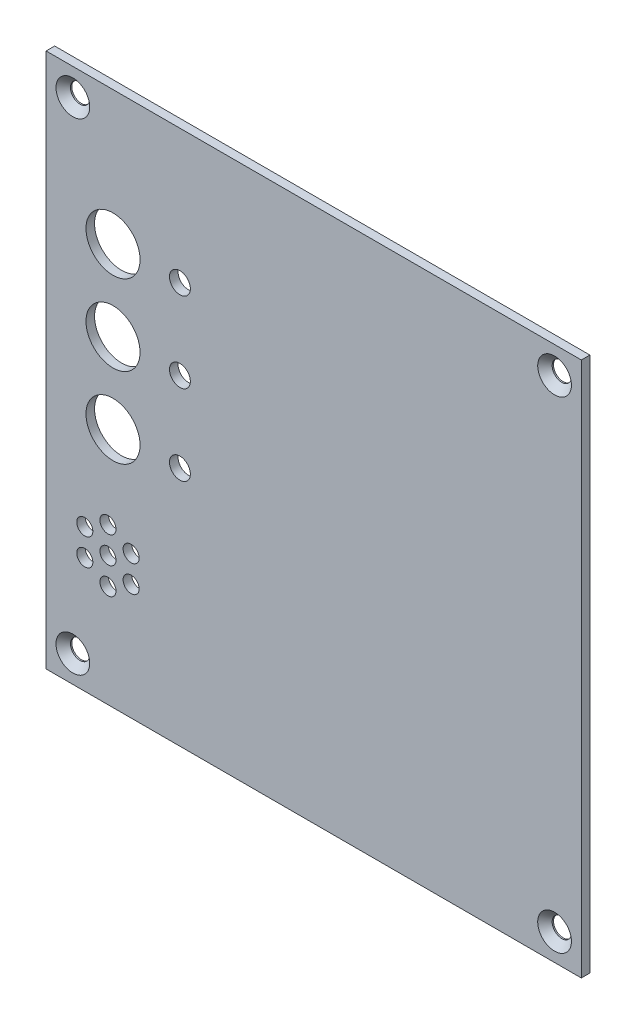
ISO-10303-21;
HEADER;
FILE_DESCRIPTION(('STEP AP214'),'2;1');
FILE_NAME('part.step','',(''),(''),'','','');
FILE_SCHEMA(('AUTOMOTIVE_DESIGN { 1 0 10303 214 1 1 1 1 }'));
ENDSEC;
DATA;
#1=APPLICATION_CONTEXT('core data for automotive mechanical design processes');
#2=APPLICATION_PROTOCOL_DEFINITION('international standard','automotive_design',2000,#1);
#3=PRODUCT_CONTEXT('',#1,'mechanical');
#4=PRODUCT('Part','Part','',(#3));
#5=PRODUCT_RELATED_PRODUCT_CATEGORY('part','',(#4));
#6=PRODUCT_DEFINITION_FORMATION('','',#4);
#7=PRODUCT_DEFINITION_CONTEXT('part definition',#1,'design');
#8=PRODUCT_DEFINITION('design','',#6,#7);
#9=PRODUCT_DEFINITION_SHAPE('','',#8);
#10=(LENGTH_UNIT() NAMED_UNIT(*) SI_UNIT(.MILLI.,.METRE.));
#11=(NAMED_UNIT(*) PLANE_ANGLE_UNIT() SI_UNIT($,.RADIAN.));
#12=(NAMED_UNIT(*) SI_UNIT($,.STERADIAN.) SOLID_ANGLE_UNIT());
#13=UNCERTAINTY_MEASURE_WITH_UNIT(LENGTH_MEASURE(1.E-05),#10,'distance_accuracy_value','');
#14=(GEOMETRIC_REPRESENTATION_CONTEXT(3) GLOBAL_UNCERTAINTY_ASSIGNED_CONTEXT((#13)) GLOBAL_UNIT_ASSIGNED_CONTEXT((#10,
#11,#12)) REPRESENTATION_CONTEXT('',''));
#15=CARTESIAN_POINT('',(0.,0.,0.));
#16=DIRECTION('',(0.,0.,1.));
#17=DIRECTION('',(1.,0.,0.));
#18=AXIS2_PLACEMENT_3D('',#15,#16,#17);
#19=CARTESIAN_POINT('',(0.,0.,0.));
#20=DIRECTION('',(0.,0.,-1.));
#21=DIRECTION('',(-1.,0.,0.));
#22=AXIS2_PLACEMENT_3D('',#19,#20,#21);
#23=PLANE('',#22);
#24=CARTESIAN_POINT('',(7.22687298107787,21.63,0.));
#25=DIRECTION('',(0.,0.,1.));
#26=DIRECTION('',(1.,0.,0.));
#27=AXIS2_PLACEMENT_3D('',#24,#25,#26);
#28=CIRCLE('',#27,1.5);
#29=CARTESIAN_POINT('',(8.72687298107787,21.63,0.));
#30=VERTEX_POINT('',#29);
#31=EDGE_CURVE('E182',#30,#30,#28,.T.);
#32=ORIENTED_EDGE('',*,*,#31,.T.);
#33=EDGE_LOOP('',(#32));
#34=FACE_BOUND('',#33,.T.);
#35=CARTESIAN_POINT('',(11.5570000000001,19.13,0.));
#36=DIRECTION('',(0.,0.,1.));
#37=DIRECTION('',(1.,0.,0.));
#38=AXIS2_PLACEMENT_3D('',#35,#36,#37);
#39=CIRCLE('',#38,1.5);
#40=CARTESIAN_POINT('',(13.0570000000001,19.13,0.));
#41=VERTEX_POINT('',#40);
#42=EDGE_CURVE('E189',#41,#41,#39,.T.);
#43=ORIENTED_EDGE('',*,*,#42,.T.);
#44=EDGE_LOOP('',(#43));
#45=FACE_BOUND('',#44,.T.);
#46=CARTESIAN_POINT('',(15.8871270189223,21.63,0.));
#47=DIRECTION('',(0.,0.,1.));
#48=DIRECTION('',(1.,0.,0.));
#49=AXIS2_PLACEMENT_3D('',#46,#47,#48);
#50=CIRCLE('',#49,1.5);
#51=CARTESIAN_POINT('',(17.3871270189223,21.63,0.));
#52=VERTEX_POINT('',#51);
#53=EDGE_CURVE('E195',#52,#52,#50,.T.);
#54=ORIENTED_EDGE('',*,*,#53,.T.);
#55=EDGE_LOOP('',(#54));
#56=FACE_BOUND('',#55,.T.);
#57=CARTESIAN_POINT('',(15.8871270189222,26.63,0.));
#58=DIRECTION('',(0.,0.,1.));
#59=DIRECTION('',(1.,0.,0.));
#60=AXIS2_PLACEMENT_3D('',#57,#58,#59);
#61=CIRCLE('',#60,1.5);
#62=CARTESIAN_POINT('',(17.3871270189222,26.63,0.));
#63=VERTEX_POINT('',#62);
#64=EDGE_CURVE('E171',#63,#63,#61,.T.);
#65=ORIENTED_EDGE('',*,*,#64,.T.);
#66=EDGE_LOOP('',(#65));
#67=FACE_BOUND('',#66,.T.);
#68=CARTESIAN_POINT('',(25.,75.,0.));
#69=DIRECTION('',(0.,0.,1.));
#70=DIRECTION('',(1.,0.,0.));
#71=AXIS2_PLACEMENT_3D('',#68,#69,#70);
#72=CIRCLE('',#71,1.94999999999999);
#73=CARTESIAN_POINT('',(26.95,75.,0.));
#74=VERTEX_POINT('',#73);
#75=EDGE_CURVE('E152',#74,#74,#72,.T.);
#76=ORIENTED_EDGE('',*,*,#75,.T.);
#77=EDGE_LOOP('',(#76));
#78=FACE_BOUND('',#77,.T.);
#79=CARTESIAN_POINT('',(11.557,24.13,0.));
#80=DIRECTION('',(0.,0.,1.));
#81=DIRECTION('',(1.,0.,0.));
#82=AXIS2_PLACEMENT_3D('',#79,#80,#81);
#83=CIRCLE('',#82,1.5);
#84=CARTESIAN_POINT('',(13.057,24.13,0.));
#85=VERTEX_POINT('',#84);
#86=EDGE_CURVE('E158',#85,#85,#83,.T.);
#87=ORIENTED_EDGE('',*,*,#86,.T.);
#88=EDGE_LOOP('',(#87));
#89=FACE_BOUND('',#88,.T.);
#90=CARTESIAN_POINT('',(12.5000000000002,60.,0.));
#91=DIRECTION('',(0.,0.,1.));
#92=DIRECTION('',(1.,0.,0.));
#93=AXIS2_PLACEMENT_3D('',#90,#91,#92);
#94=CIRCLE('',#93,5.05);
#95=CARTESIAN_POINT('',(17.5500000000002,60.,0.));
#96=VERTEX_POINT('',#95);
#97=EDGE_CURVE('E159',#96,#96,#94,.T.);
#98=ORIENTED_EDGE('',*,*,#97,.T.);
#99=EDGE_LOOP('',(#98));
#100=FACE_BOUND('',#99,.T.);
#101=CARTESIAN_POINT('',(11.557,29.13,0.));
#102=DIRECTION('',(0.,0.,1.));
#103=DIRECTION('',(1.,0.,0.));
#104=AXIS2_PLACEMENT_3D('',#101,#102,#103);
#105=CIRCLE('',#104,1.5);
#106=CARTESIAN_POINT('',(13.057,29.13,0.));
#107=VERTEX_POINT('',#106);
#108=EDGE_CURVE('E170',#107,#107,#105,.T.);
#109=ORIENTED_EDGE('',*,*,#108,.T.);
#110=EDGE_LOOP('',(#109));
#111=FACE_BOUND('',#110,.T.);
#112=CARTESIAN_POINT('',(7.22687298107785,26.63,0.));
#113=DIRECTION('',(0.,0.,1.));
#114=DIRECTION('',(1.,0.,0.));
#115=AXIS2_PLACEMENT_3D('',#112,#113,#114);
#116=CIRCLE('',#115,1.5);
#117=CARTESIAN_POINT('',(8.72687298107786,26.63,0.));
#118=VERTEX_POINT('',#117);
#119=EDGE_CURVE('E183',#118,#118,#116,.T.);
#120=ORIENTED_EDGE('',*,*,#119,.T.);
#121=EDGE_LOOP('',(#120));
#122=FACE_BOUND('',#121,.T.);
#123=CARTESIAN_POINT('',(12.5000000000003,45.,0.));
#124=DIRECTION('',(0.,0.,1.));
#125=DIRECTION('',(1.,0.,0.));
#126=AXIS2_PLACEMENT_3D('',#123,#124,#125);
#127=CIRCLE('',#126,5.05);
#128=CARTESIAN_POINT('',(17.5500000000003,45.,0.));
#129=VERTEX_POINT('',#128);
#130=EDGE_CURVE('E218',#129,#129,#127,.T.);
#131=ORIENTED_EDGE('',*,*,#130,.T.);
#132=EDGE_LOOP('',(#131));
#133=FACE_BOUND('',#132,.T.);
#134=CARTESIAN_POINT('',(25.,60.,0.));
#135=DIRECTION('',(0.,0.,1.));
#136=DIRECTION('',(1.,0.,0.));
#137=AXIS2_PLACEMENT_3D('',#134,#135,#136);
#138=CIRCLE('',#137,1.95);
#139=CARTESIAN_POINT('',(26.95,60.,0.));
#140=VERTEX_POINT('',#139);
#141=EDGE_CURVE('E212',#140,#140,#138,.T.);
#142=ORIENTED_EDGE('',*,*,#141,.T.);
#143=EDGE_LOOP('',(#142));
#144=FACE_BOUND('',#143,.T.);
#145=CARTESIAN_POINT('',(25.,45.,0.));
#146=DIRECTION('',(0.,0.,1.));
#147=DIRECTION('',(1.,0.,0.));
#148=AXIS2_PLACEMENT_3D('',#145,#146,#147);
#149=CIRCLE('',#148,1.95);
#150=CARTESIAN_POINT('',(26.95,45.,0.));
#151=VERTEX_POINT('',#150);
#152=EDGE_CURVE('E206',#151,#151,#149,.T.);
#153=ORIENTED_EDGE('',*,*,#152,.T.);
#154=EDGE_LOOP('',(#153));
#155=FACE_BOUND('',#154,.T.);
#156=CARTESIAN_POINT('',(12.5,75.,0.));
#157=DIRECTION('',(0.,0.,1.));
#158=DIRECTION('',(1.,0.,0.));
#159=AXIS2_PLACEMENT_3D('',#156,#157,#158);
#160=CIRCLE('',#159,5.05);
#161=CARTESIAN_POINT('',(17.55,75.,0.));
#162=VERTEX_POINT('',#161);
#163=EDGE_CURVE('E148',#162,#162,#160,.T.);
#164=ORIENTED_EDGE('',*,*,#163,.T.);
#165=EDGE_LOOP('',(#164));
#166=FACE_BOUND('',#165,.T.);
#167=CARTESIAN_POINT('',(4.99999999999999,95.,0.));
#168=DIRECTION('',(0.,0.,1.));
#169=DIRECTION('',(1.,0.,0.));
#170=AXIS2_PLACEMENT_3D('',#167,#168,#169);
#171=CIRCLE('',#170,1.8);
#172=CARTESIAN_POINT('',(6.79999999999999,95.,0.));
#173=VERTEX_POINT('',#172);
#174=EDGE_CURVE('E139',#173,#173,#171,.T.);
#175=ORIENTED_EDGE('',*,*,#174,.T.);
#176=EDGE_LOOP('',(#175));
#177=FACE_BOUND('',#176,.T.);
#178=CARTESIAN_POINT('',(95.,95.,0.));
#179=DIRECTION('',(0.,0.,1.));
#180=DIRECTION('',(1.,0.,0.));
#181=AXIS2_PLACEMENT_3D('',#178,#179,#180);
#182=CIRCLE('',#181,1.8);
#183=CARTESIAN_POINT('',(96.8,95.,0.));
#184=VERTEX_POINT('',#183);
#185=EDGE_CURVE('E130',#184,#184,#182,.T.);
#186=ORIENTED_EDGE('',*,*,#185,.T.);
#187=EDGE_LOOP('',(#186));
#188=FACE_BOUND('',#187,.T.);
#189=DIRECTION('',(0.,-1.,0.));
#190=VECTOR('',#189,1.);
#191=CARTESIAN_POINT('',(0.,0.,0.));
#192=LINE('',#191,#190);
#193=CARTESIAN_POINT('',(0.,100.,0.));
#194=VERTEX_POINT('',#193);
#195=CARTESIAN_POINT('',(0.,0.,0.));
#196=VERTEX_POINT('',#195);
#197=EDGE_CURVE('E99',#194,#196,#192,.T.);
#198=ORIENTED_EDGE('',*,*,#197,.F.);
#199=DIRECTION('',(-1.,0.,0.));
#200=VECTOR('',#199,1.);
#201=CARTESIAN_POINT('',(0.,100.,0.));
#202=LINE('',#201,#200);
#203=CARTESIAN_POINT('',(100.,100.,0.));
#204=VERTEX_POINT('',#203);
#205=EDGE_CURVE('E75',#204,#194,#202,.T.);
#206=ORIENTED_EDGE('',*,*,#205,.F.);
#207=DIRECTION('',(0.,1.,0.));
#208=VECTOR('',#207,1.);
#209=CARTESIAN_POINT('',(100.,0.,0.));
#210=LINE('',#209,#208);
#211=CARTESIAN_POINT('',(100.,0.,0.));
#212=VERTEX_POINT('',#211);
#213=EDGE_CURVE('E69',#212,#204,#210,.T.);
#214=ORIENTED_EDGE('',*,*,#213,.F.);
#215=DIRECTION('',(1.,0.,0.));
#216=VECTOR('',#215,1.);
#217=CARTESIAN_POINT('',(0.,0.,0.));
#218=LINE('',#217,#216);
#219=EDGE_CURVE('E91',#196,#212,#218,.T.);
#220=ORIENTED_EDGE('',*,*,#219,.F.);
#221=EDGE_LOOP('',(#198,#206,#214,#220));
#222=FACE_BOUND('',#221,.T.);
#223=CARTESIAN_POINT('',(4.99999999999999,5.,0.));
#224=DIRECTION('',(0.,0.,1.));
#225=DIRECTION('',(1.,0.,0.));
#226=AXIS2_PLACEMENT_3D('',#223,#224,#225);
#227=CIRCLE('',#226,1.8);
#228=CARTESIAN_POINT('',(6.79999999999999,5.,0.));
#229=VERTEX_POINT('',#228);
#230=EDGE_CURVE('E102',#229,#229,#227,.T.);
#231=ORIENTED_EDGE('',*,*,#230,.T.);
#232=EDGE_LOOP('',(#231));
#233=FACE_BOUND('',#232,.T.);
#234=CARTESIAN_POINT('',(95.,5.,0.));
#235=DIRECTION('',(0.,0.,1.));
#236=DIRECTION('',(1.,0.,0.));
#237=AXIS2_PLACEMENT_3D('',#234,#235,#236);
#238=CIRCLE('',#237,1.8);
#239=CARTESIAN_POINT('',(96.8,5.,0.));
#240=VERTEX_POINT('',#239);
#241=EDGE_CURVE('E121',#240,#240,#238,.T.);
#242=ORIENTED_EDGE('',*,*,#241,.T.);
#243=EDGE_LOOP('',(#242));
#244=FACE_BOUND('',#243,.T.);
#245=ADVANCED_FACE('F35',(#34,#45,#56,#67,#78,#89,#100,#111,#122,#133,#144,#155,#166,#177,#188,
#222,#233,#244),#23,.T.);
#246=CARTESIAN_POINT('',(0.,0.,1.6));
#247=DIRECTION('',(1.,0.,0.));
#248=DIRECTION('',(0.,1.,0.));
#249=AXIS2_PLACEMENT_3D('',#246,#247,#248);
#250=PLANE('',#249);
#251=ORIENTED_EDGE('',*,*,#197,.T.);
#252=DIRECTION('',(0.,0.,-1.));
#253=VECTOR('',#252,1.);
#254=CARTESIAN_POINT('',(0.,0.,1.6));
#255=LINE('',#254,#253);
#256=CARTESIAN_POINT('',(0.,0.,1.6));
#257=VERTEX_POINT('',#256);
#258=EDGE_CURVE('E11',#257,#196,#255,.T.);
#259=ORIENTED_EDGE('',*,*,#258,.F.);
#260=DIRECTION('',(0.,-1.,0.));
#261=VECTOR('',#260,1.);
#262=CARTESIAN_POINT('',(0.,0.,1.6));
#263=LINE('',#262,#261);
#264=CARTESIAN_POINT('',(0.,100.,1.6));
#265=VERTEX_POINT('',#264);
#266=EDGE_CURVE('E87',#265,#257,#263,.T.);
#267=ORIENTED_EDGE('',*,*,#266,.F.);
#268=DIRECTION('',(0.,0.,-1.));
#269=VECTOR('',#268,1.);
#270=CARTESIAN_POINT('',(0.,100.,1.6));
#271=LINE('',#270,#269);
#272=EDGE_CURVE('E95',#265,#194,#271,.T.);
#273=ORIENTED_EDGE('',*,*,#272,.T.);
#274=EDGE_LOOP('',(#251,#259,#267,#273));
#275=FACE_BOUND('',#274,.T.);
#276=ADVANCED_FACE('F37',(#275),#250,.F.);
#277=CARTESIAN_POINT('',(0.,0.,1.6));
#278=DIRECTION('',(0.,1.,0.));
#279=DIRECTION('',(0.,0.,1.));
#280=AXIS2_PLACEMENT_3D('',#277,#278,#279);
#281=PLANE('',#280);
#282=ORIENTED_EDGE('',*,*,#219,.T.);
#283=DIRECTION('',(0.,0.,-1.));
#284=VECTOR('',#283,1.);
#285=CARTESIAN_POINT('',(100.,0.,1.6));
#286=LINE('',#285,#284);
#287=CARTESIAN_POINT('',(100.,0.,1.6));
#288=VERTEX_POINT('',#287);
#289=EDGE_CURVE('E44',#288,#212,#286,.T.);
#290=ORIENTED_EDGE('',*,*,#289,.F.);
#291=DIRECTION('',(1.,0.,0.));
#292=VECTOR('',#291,1.);
#293=CARTESIAN_POINT('',(0.,0.,1.6));
#294=LINE('',#293,#292);
#295=EDGE_CURVE('E82',#257,#288,#294,.T.);
#296=ORIENTED_EDGE('',*,*,#295,.F.);
#297=ORIENTED_EDGE('',*,*,#258,.T.);
#298=EDGE_LOOP('',(#282,#290,#296,#297));
#299=FACE_BOUND('',#298,.T.);
#300=ADVANCED_FACE('F90',(#299),#281,.F.);
#301=CARTESIAN_POINT('',(100.,0.,1.6));
#302=DIRECTION('',(-1.,0.,0.));
#303=DIRECTION('',(0.,-1.,0.));
#304=AXIS2_PLACEMENT_3D('',#301,#302,#303);
#305=PLANE('',#304);
#306=ORIENTED_EDGE('',*,*,#213,.T.);
#307=DIRECTION('',(0.,0.,-1.));
#308=VECTOR('',#307,1.);
#309=CARTESIAN_POINT('',(100.,100.,1.6));
#310=LINE('',#309,#308);
#311=CARTESIAN_POINT('',(100.,100.,1.6));
#312=VERTEX_POINT('',#311);
#313=EDGE_CURVE('E92',#312,#204,#310,.T.);
#314=ORIENTED_EDGE('',*,*,#313,.F.);
#315=DIRECTION('',(0.,1.,0.));
#316=VECTOR('',#315,1.);
#317=CARTESIAN_POINT('',(100.,0.,1.6));
#318=LINE('',#317,#316);
#319=EDGE_CURVE('E85',#288,#312,#318,.T.);
#320=ORIENTED_EDGE('',*,*,#319,.F.);
#321=ORIENTED_EDGE('',*,*,#289,.T.);
#322=EDGE_LOOP('',(#306,#314,#320,#321));
#323=FACE_BOUND('',#322,.T.);
#324=ADVANCED_FACE('F93',(#323),#305,.F.);
#325=CARTESIAN_POINT('',(0.,100.,1.6));
#326=DIRECTION('',(0.,-1.,0.));
#327=DIRECTION('',(0.,0.,-1.));
#328=AXIS2_PLACEMENT_3D('',#325,#326,#327);
#329=PLANE('',#328);
#330=ORIENTED_EDGE('',*,*,#205,.T.);
#331=ORIENTED_EDGE('',*,*,#272,.F.);
#332=DIRECTION('',(-1.,0.,0.));
#333=VECTOR('',#332,1.);
#334=CARTESIAN_POINT('',(0.,100.,1.6));
#335=LINE('',#334,#333);
#336=EDGE_CURVE('E52',#312,#265,#335,.T.);
#337=ORIENTED_EDGE('',*,*,#336,.F.);
#338=ORIENTED_EDGE('',*,*,#313,.T.);
#339=EDGE_LOOP('',(#330,#331,#337,#338));
#340=FACE_BOUND('',#339,.T.);
#341=ADVANCED_FACE('F107',(#340),#329,.F.);
#342=CARTESIAN_POINT('',(0.,0.,1.6));
#343=DIRECTION('',(0.,0.,-1.));
#344=DIRECTION('',(-1.,0.,0.));
#345=AXIS2_PLACEMENT_3D('',#342,#343,#344);
#346=PLANE('',#345);
#347=CARTESIAN_POINT('',(7.22687298107787,21.63,1.6));
#348=DIRECTION('',(0.,0.,1.));
#349=DIRECTION('',(1.,0.,0.));
#350=AXIS2_PLACEMENT_3D('',#347,#348,#349);
#351=CIRCLE('',#350,1.5);
#352=CARTESIAN_POINT('',(8.72687298107787,21.63,1.6));
#353=VERTEX_POINT('',#352);
#354=EDGE_CURVE('E179',#353,#353,#351,.T.);
#355=ORIENTED_EDGE('',*,*,#354,.F.);
#356=EDGE_LOOP('',(#355));
#357=FACE_BOUND('',#356,.T.);
#358=CARTESIAN_POINT('',(11.5570000000001,19.13,1.6));
#359=DIRECTION('',(0.,0.,1.));
#360=DIRECTION('',(1.,0.,0.));
#361=AXIS2_PLACEMENT_3D('',#358,#359,#360);
#362=CIRCLE('',#361,1.5);
#363=CARTESIAN_POINT('',(13.0570000000001,19.13,1.6));
#364=VERTEX_POINT('',#363);
#365=EDGE_CURVE('E186',#364,#364,#362,.T.);
#366=ORIENTED_EDGE('',*,*,#365,.F.);
#367=EDGE_LOOP('',(#366));
#368=FACE_BOUND('',#367,.T.);
#369=CARTESIAN_POINT('',(15.8871270189223,21.63,1.6));
#370=DIRECTION('',(0.,0.,1.));
#371=DIRECTION('',(1.,0.,0.));
#372=AXIS2_PLACEMENT_3D('',#369,#370,#371);
#373=CIRCLE('',#372,1.5);
#374=CARTESIAN_POINT('',(17.3871270189223,21.63,1.6));
#375=VERTEX_POINT('',#374);
#376=EDGE_CURVE('E192',#375,#375,#373,.T.);
#377=ORIENTED_EDGE('',*,*,#376,.F.);
#378=EDGE_LOOP('',(#377));
#379=FACE_BOUND('',#378,.T.);
#380=CARTESIAN_POINT('',(15.8871270189222,26.63,1.6));
#381=DIRECTION('',(0.,0.,1.));
#382=DIRECTION('',(1.,0.,0.));
#383=AXIS2_PLACEMENT_3D('',#380,#381,#382);
#384=CIRCLE('',#383,1.5);
#385=CARTESIAN_POINT('',(17.3871270189222,26.63,1.6));
#386=VERTEX_POINT('',#385);
#387=EDGE_CURVE('E198',#386,#386,#384,.T.);
#388=ORIENTED_EDGE('',*,*,#387,.F.);
#389=EDGE_LOOP('',(#388));
#390=FACE_BOUND('',#389,.T.);
#391=CARTESIAN_POINT('',(25.,75.,1.6));
#392=DIRECTION('',(0.,0.,1.));
#393=DIRECTION('',(1.,0.,0.));
#394=AXIS2_PLACEMENT_3D('',#391,#392,#393);
#395=CIRCLE('',#394,1.94999999999999);
#396=CARTESIAN_POINT('',(26.95,75.,1.6));
#397=VERTEX_POINT('',#396);
#398=EDGE_CURVE('E162',#397,#397,#395,.T.);
#399=ORIENTED_EDGE('',*,*,#398,.F.);
#400=EDGE_LOOP('',(#399));
#401=FACE_BOUND('',#400,.T.);
#402=CARTESIAN_POINT('',(11.557,24.13,1.6));
#403=DIRECTION('',(0.,0.,1.));
#404=DIRECTION('',(1.,0.,0.));
#405=AXIS2_PLACEMENT_3D('',#402,#403,#404);
#406=CIRCLE('',#405,1.5);
#407=CARTESIAN_POINT('',(13.057,24.13,1.6));
#408=VERTEX_POINT('',#407);
#409=EDGE_CURVE('E155',#408,#408,#406,.T.);
#410=ORIENTED_EDGE('',*,*,#409,.F.);
#411=EDGE_LOOP('',(#410));
#412=FACE_BOUND('',#411,.T.);
#413=CARTESIAN_POINT('',(12.5000000000002,60.,1.6));
#414=DIRECTION('',(0.,0.,1.));
#415=DIRECTION('',(1.,0.,0.));
#416=AXIS2_PLACEMENT_3D('',#413,#414,#415);
#417=CIRCLE('',#416,5.05);
#418=CARTESIAN_POINT('',(17.5500000000002,60.,1.6));
#419=VERTEX_POINT('',#418);
#420=EDGE_CURVE('E174',#419,#419,#417,.T.);
#421=ORIENTED_EDGE('',*,*,#420,.F.);
#422=EDGE_LOOP('',(#421));
#423=FACE_BOUND('',#422,.T.);
#424=CARTESIAN_POINT('',(11.557,29.13,1.6));
#425=DIRECTION('',(0.,0.,1.));
#426=DIRECTION('',(1.,0.,0.));
#427=AXIS2_PLACEMENT_3D('',#424,#425,#426);
#428=CIRCLE('',#427,1.5);
#429=CARTESIAN_POINT('',(13.057,29.13,1.6));
#430=VERTEX_POINT('',#429);
#431=EDGE_CURVE('E167',#430,#430,#428,.T.);
#432=ORIENTED_EDGE('',*,*,#431,.F.);
#433=EDGE_LOOP('',(#432));
#434=FACE_BOUND('',#433,.T.);
#435=CARTESIAN_POINT('',(7.22687298107785,26.63,1.6));
#436=DIRECTION('',(0.,0.,1.));
#437=DIRECTION('',(1.,0.,0.));
#438=AXIS2_PLACEMENT_3D('',#435,#436,#437);
#439=CIRCLE('',#438,1.5);
#440=CARTESIAN_POINT('',(8.72687298107786,26.63,1.6));
#441=VERTEX_POINT('',#440);
#442=EDGE_CURVE('E221',#441,#441,#439,.T.);
#443=ORIENTED_EDGE('',*,*,#442,.F.);
#444=EDGE_LOOP('',(#443));
#445=FACE_BOUND('',#444,.T.);
#446=CARTESIAN_POINT('',(12.5000000000003,45.,1.6));
#447=DIRECTION('',(0.,0.,1.));
#448=DIRECTION('',(1.,0.,0.));
#449=AXIS2_PLACEMENT_3D('',#446,#447,#448);
#450=CIRCLE('',#449,5.05);
#451=CARTESIAN_POINT('',(17.5500000000003,45.,1.6));
#452=VERTEX_POINT('',#451);
#453=EDGE_CURVE('E215',#452,#452,#450,.T.);
#454=ORIENTED_EDGE('',*,*,#453,.F.);
#455=EDGE_LOOP('',(#454));
#456=FACE_BOUND('',#455,.T.);
#457=CARTESIAN_POINT('',(25.,60.,1.6));
#458=DIRECTION('',(0.,0.,1.));
#459=DIRECTION('',(1.,0.,0.));
#460=AXIS2_PLACEMENT_3D('',#457,#458,#459);
#461=CIRCLE('',#460,1.95);
#462=CARTESIAN_POINT('',(26.95,60.,1.6));
#463=VERTEX_POINT('',#462);
#464=EDGE_CURVE('E209',#463,#463,#461,.T.);
#465=ORIENTED_EDGE('',*,*,#464,.F.);
#466=EDGE_LOOP('',(#465));
#467=FACE_BOUND('',#466,.T.);
#468=CARTESIAN_POINT('',(25.,45.,1.6));
#469=DIRECTION('',(0.,0.,1.));
#470=DIRECTION('',(1.,0.,0.));
#471=AXIS2_PLACEMENT_3D('',#468,#469,#470);
#472=CIRCLE('',#471,1.95);
#473=CARTESIAN_POINT('',(26.95,45.,1.6));
#474=VERTEX_POINT('',#473);
#475=EDGE_CURVE('E203',#474,#474,#472,.T.);
#476=ORIENTED_EDGE('',*,*,#475,.F.);
#477=EDGE_LOOP('',(#476));
#478=FACE_BOUND('',#477,.T.);
#479=CARTESIAN_POINT('',(12.5,75.,1.6));
#480=DIRECTION('',(0.,0.,1.));
#481=DIRECTION('',(1.,0.,0.));
#482=AXIS2_PLACEMENT_3D('',#479,#480,#481);
#483=CIRCLE('',#482,5.05);
#484=CARTESIAN_POINT('',(17.55,75.,1.6));
#485=VERTEX_POINT('',#484);
#486=EDGE_CURVE('E149',#485,#485,#483,.T.);
#487=ORIENTED_EDGE('',*,*,#486,.F.);
#488=EDGE_LOOP('',(#487));
#489=FACE_BOUND('',#488,.T.);
#490=CARTESIAN_POINT('',(4.99999999999999,95.,1.6));
#491=DIRECTION('',(0.,0.,1.));
#492=DIRECTION('',(1.,0.,0.));
#493=AXIS2_PLACEMENT_3D('',#490,#491,#492);
#494=CIRCLE('',#493,3.15);
#495=CARTESIAN_POINT('',(8.14999999999999,95.,1.6));
#496=VERTEX_POINT('',#495);
#497=EDGE_CURVE('E145',#496,#496,#494,.T.);
#498=ORIENTED_EDGE('',*,*,#497,.F.);
#499=EDGE_LOOP('',(#498));
#500=FACE_BOUND('',#499,.T.);
#501=CARTESIAN_POINT('',(95.,95.,1.6));
#502=DIRECTION('',(0.,0.,1.));
#503=DIRECTION('',(1.,0.,0.));
#504=AXIS2_PLACEMENT_3D('',#501,#502,#503);
#505=CIRCLE('',#504,3.15);
#506=CARTESIAN_POINT('',(98.15,95.,1.6));
#507=VERTEX_POINT('',#506);
#508=EDGE_CURVE('E136',#507,#507,#505,.T.);
#509=ORIENTED_EDGE('',*,*,#508,.F.);
#510=EDGE_LOOP('',(#509));
#511=FACE_BOUND('',#510,.T.);
#512=CARTESIAN_POINT('',(95.,5.,1.6));
#513=DIRECTION('',(0.,0.,1.));
#514=DIRECTION('',(1.,0.,0.));
#515=AXIS2_PLACEMENT_3D('',#512,#513,#514);
#516=CIRCLE('',#515,3.15);
#517=CARTESIAN_POINT('',(98.15,5.,1.6));
#518=VERTEX_POINT('',#517);
#519=EDGE_CURVE('E127',#518,#518,#516,.T.);
#520=ORIENTED_EDGE('',*,*,#519,.F.);
#521=EDGE_LOOP('',(#520));
#522=FACE_BOUND('',#521,.T.);
#523=CARTESIAN_POINT('',(4.99999999999999,5.,1.6));
#524=DIRECTION('',(0.,0.,1.));
#525=DIRECTION('',(1.,0.,0.));
#526=AXIS2_PLACEMENT_3D('',#523,#524,#525);
#527=CIRCLE('',#526,3.15);
#528=CARTESIAN_POINT('',(8.14999999999999,5.,1.6));
#529=VERTEX_POINT('',#528);
#530=EDGE_CURVE('E118',#529,#529,#527,.T.);
#531=ORIENTED_EDGE('',*,*,#530,.F.);
#532=EDGE_LOOP('',(#531));
#533=FACE_BOUND('',#532,.T.);
#534=ORIENTED_EDGE('',*,*,#266,.T.);
#535=ORIENTED_EDGE('',*,*,#295,.T.);
#536=ORIENTED_EDGE('',*,*,#319,.T.);
#537=ORIENTED_EDGE('',*,*,#336,.T.);
#538=EDGE_LOOP('',(#534,#535,#536,#537));
#539=FACE_BOUND('',#538,.T.);
#540=ADVANCED_FACE('F83',(#357,#368,#379,#390,#401,#412,#423,#434,#445,#456,#467,#478,#489,#500,
#511,#522,#533,#539),#346,.F.);
#541=CARTESIAN_POINT('',(4.99999999999999,5.,1.6));
#542=DIRECTION('',(0.,0.,1.));
#543=DIRECTION('',(1.,0.,0.));
#544=AXIS2_PLACEMENT_3D('',#541,#542,#543);
#545=CYLINDRICAL_SURFACE('',#544,1.8);
#546=ORIENTED_EDGE('',*,*,#230,.F.);
#547=EDGE_LOOP('',(#546));
#548=FACE_BOUND('',#547,.T.);
#549=CARTESIAN_POINT('',(4.99999999999999,5.,0.25));
#550=DIRECTION('',(0.,0.,1.));
#551=DIRECTION('',(1.,0.,0.));
#552=AXIS2_PLACEMENT_3D('',#549,#550,#551);
#553=CIRCLE('',#552,1.8);
#554=CARTESIAN_POINT('',(6.79999999999999,5.,0.25));
#555=VERTEX_POINT('',#554);
#556=EDGE_CURVE('E115',#555,#555,#553,.T.);
#557=ORIENTED_EDGE('',*,*,#556,.T.);
#558=EDGE_LOOP('',(#557));
#559=FACE_BOUND('',#558,.T.);
#560=ADVANCED_FACE('F239',(#548,#559),#545,.F.);
#561=CARTESIAN_POINT('',(4.99999999999999,5.,1.6));
#562=DIRECTION('',(0.,0.,1.));
#563=DIRECTION('',(1.,0.,0.));
#564=AXIS2_PLACEMENT_3D('',#561,#562,#563);
#565=CONICAL_SURFACE('',#564,3.15,0.785398163397449);
#566=ORIENTED_EDGE('',*,*,#556,.F.);
#567=EDGE_LOOP('',(#566));
#568=FACE_BOUND('',#567,.T.);
#569=ORIENTED_EDGE('',*,*,#530,.T.);
#570=EDGE_LOOP('',(#569));
#571=FACE_BOUND('',#570,.T.);
#572=ADVANCED_FACE('F258',(#568,#571),#565,.F.);
#573=CARTESIAN_POINT('',(95.,5.,1.6));
#574=DIRECTION('',(0.,0.,1.));
#575=DIRECTION('',(1.,0.,0.));
#576=AXIS2_PLACEMENT_3D('',#573,#574,#575);
#577=CYLINDRICAL_SURFACE('',#576,1.8);
#578=ORIENTED_EDGE('',*,*,#241,.F.);
#579=EDGE_LOOP('',(#578));
#580=FACE_BOUND('',#579,.T.);
#581=CARTESIAN_POINT('',(95.,5.,0.25));
#582=DIRECTION('',(0.,0.,1.));
#583=DIRECTION('',(1.,0.,0.));
#584=AXIS2_PLACEMENT_3D('',#581,#582,#583);
#585=CIRCLE('',#584,1.8);
#586=CARTESIAN_POINT('',(96.8,5.,0.25));
#587=VERTEX_POINT('',#586);
#588=EDGE_CURVE('E124',#587,#587,#585,.T.);
#589=ORIENTED_EDGE('',*,*,#588,.T.);
#590=EDGE_LOOP('',(#589));
#591=FACE_BOUND('',#590,.T.);
#592=ADVANCED_FACE('F260',(#580,#591),#577,.F.);
#593=CARTESIAN_POINT('',(95.,5.,1.6));
#594=DIRECTION('',(0.,0.,1.));
#595=DIRECTION('',(1.,0.,0.));
#596=AXIS2_PLACEMENT_3D('',#593,#594,#595);
#597=CONICAL_SURFACE('',#596,3.15,0.78539816339745);
#598=ORIENTED_EDGE('',*,*,#588,.F.);
#599=EDGE_LOOP('',(#598));
#600=FACE_BOUND('',#599,.T.);
#601=ORIENTED_EDGE('',*,*,#519,.T.);
#602=EDGE_LOOP('',(#601));
#603=FACE_BOUND('',#602,.T.);
#604=ADVANCED_FACE('F267',(#600,#603),#597,.F.);
#605=CARTESIAN_POINT('',(95.,95.,1.6));
#606=DIRECTION('',(0.,0.,1.));
#607=DIRECTION('',(1.,0.,0.));
#608=AXIS2_PLACEMENT_3D('',#605,#606,#607);
#609=CYLINDRICAL_SURFACE('',#608,1.8);
#610=ORIENTED_EDGE('',*,*,#185,.F.);
#611=EDGE_LOOP('',(#610));
#612=FACE_BOUND('',#611,.T.);
#613=CARTESIAN_POINT('',(95.,95.,0.25));
#614=DIRECTION('',(0.,0.,1.));
#615=DIRECTION('',(1.,0.,0.));
#616=AXIS2_PLACEMENT_3D('',#613,#614,#615);
#617=CIRCLE('',#616,1.8);
#618=CARTESIAN_POINT('',(96.8,95.,0.25));
#619=VERTEX_POINT('',#618);
#620=EDGE_CURVE('E133',#619,#619,#617,.T.);
#621=ORIENTED_EDGE('',*,*,#620,.T.);
#622=EDGE_LOOP('',(#621));
#623=FACE_BOUND('',#622,.T.);
#624=ADVANCED_FACE('F326',(#612,#623),#609,.F.);
#625=CARTESIAN_POINT('',(95.,95.,1.6));
#626=DIRECTION('',(0.,0.,1.));
#627=DIRECTION('',(1.,0.,0.));
#628=AXIS2_PLACEMENT_3D('',#625,#626,#627);
#629=CONICAL_SURFACE('',#628,3.15,0.78539816339745);
#630=ORIENTED_EDGE('',*,*,#620,.F.);
#631=EDGE_LOOP('',(#630));
#632=FACE_BOUND('',#631,.T.);
#633=ORIENTED_EDGE('',*,*,#508,.T.);
#634=EDGE_LOOP('',(#633));
#635=FACE_BOUND('',#634,.T.);
#636=ADVANCED_FACE('F336',(#632,#635),#629,.F.);
#637=CARTESIAN_POINT('',(4.99999999999999,95.,1.6));
#638=DIRECTION('',(0.,0.,1.));
#639=DIRECTION('',(1.,0.,0.));
#640=AXIS2_PLACEMENT_3D('',#637,#638,#639);
#641=CYLINDRICAL_SURFACE('',#640,1.8);
#642=ORIENTED_EDGE('',*,*,#174,.F.);
#643=EDGE_LOOP('',(#642));
#644=FACE_BOUND('',#643,.T.);
#645=CARTESIAN_POINT('',(4.99999999999999,95.,0.25));
#646=DIRECTION('',(0.,0.,1.));
#647=DIRECTION('',(1.,0.,0.));
#648=AXIS2_PLACEMENT_3D('',#645,#646,#647);
#649=CIRCLE('',#648,1.8);
#650=CARTESIAN_POINT('',(6.79999999999999,95.,0.25));
#651=VERTEX_POINT('',#650);
#652=EDGE_CURVE('E142',#651,#651,#649,.T.);
#653=ORIENTED_EDGE('',*,*,#652,.T.);
#654=EDGE_LOOP('',(#653));
#655=FACE_BOUND('',#654,.T.);
#656=ADVANCED_FACE('F346',(#644,#655),#641,.F.);
#657=CARTESIAN_POINT('',(4.99999999999999,95.,1.6));
#658=DIRECTION('',(0.,0.,1.));
#659=DIRECTION('',(1.,0.,0.));
#660=AXIS2_PLACEMENT_3D('',#657,#658,#659);
#661=CONICAL_SURFACE('',#660,3.15,0.785398163397449);
#662=ORIENTED_EDGE('',*,*,#652,.F.);
#663=EDGE_LOOP('',(#662));
#664=FACE_BOUND('',#663,.T.);
#665=ORIENTED_EDGE('',*,*,#497,.T.);
#666=EDGE_LOOP('',(#665));
#667=FACE_BOUND('',#666,.T.);
#668=ADVANCED_FACE('F356',(#664,#667),#661,.F.);
#669=CARTESIAN_POINT('',(12.5,75.,0.));
#670=DIRECTION('',(0.,0.,1.));
#671=DIRECTION('',(1.,0.,0.));
#672=AXIS2_PLACEMENT_3D('',#669,#670,#671);
#673=CYLINDRICAL_SURFACE('',#672,5.05);
#674=ORIENTED_EDGE('',*,*,#163,.F.);
#675=EDGE_LOOP('',(#674));
#676=FACE_BOUND('',#675,.T.);
#677=ORIENTED_EDGE('',*,*,#486,.T.);
#678=EDGE_LOOP('',(#677));
#679=FACE_BOUND('',#678,.T.);
#680=ADVANCED_FACE('F365',(#676,#679),#673,.F.);
#681=CARTESIAN_POINT('',(25.,45.,0.));
#682=DIRECTION('',(0.,0.,1.));
#683=DIRECTION('',(1.,0.,0.));
#684=AXIS2_PLACEMENT_3D('',#681,#682,#683);
#685=CYLINDRICAL_SURFACE('',#684,1.95);
#686=ORIENTED_EDGE('',*,*,#152,.F.);
#687=EDGE_LOOP('',(#686));
#688=FACE_BOUND('',#687,.T.);
#689=ORIENTED_EDGE('',*,*,#475,.T.);
#690=EDGE_LOOP('',(#689));
#691=FACE_BOUND('',#690,.T.);
#692=ADVANCED_FACE('F390',(#688,#691),#685,.F.);
#693=CARTESIAN_POINT('',(25.,60.,0.));
#694=DIRECTION('',(0.,0.,1.));
#695=DIRECTION('',(1.,0.,0.));
#696=AXIS2_PLACEMENT_3D('',#693,#694,#695);
#697=CYLINDRICAL_SURFACE('',#696,1.95);
#698=ORIENTED_EDGE('',*,*,#141,.F.);
#699=EDGE_LOOP('',(#698));
#700=FACE_BOUND('',#699,.T.);
#701=ORIENTED_EDGE('',*,*,#464,.T.);
#702=EDGE_LOOP('',(#701));
#703=FACE_BOUND('',#702,.T.);
#704=ADVANCED_FACE('F397',(#700,#703),#697,.F.);
#705=CARTESIAN_POINT('',(12.5000000000003,45.,0.));
#706=DIRECTION('',(0.,0.,1.));
#707=DIRECTION('',(1.,0.,0.));
#708=AXIS2_PLACEMENT_3D('',#705,#706,#707);
#709=CYLINDRICAL_SURFACE('',#708,5.05);
#710=ORIENTED_EDGE('',*,*,#130,.F.);
#711=EDGE_LOOP('',(#710));
#712=FACE_BOUND('',#711,.T.);
#713=ORIENTED_EDGE('',*,*,#453,.T.);
#714=EDGE_LOOP('',(#713));
#715=FACE_BOUND('',#714,.T.);
#716=ADVANCED_FACE('F233',(#712,#715),#709,.F.);
#717=CARTESIAN_POINT('',(7.22687298107785,26.63,0.));
#718=DIRECTION('',(0.,0.,1.));
#719=DIRECTION('',(1.,0.,0.));
#720=AXIS2_PLACEMENT_3D('',#717,#718,#719);
#721=CYLINDRICAL_SURFACE('',#720,1.5);
#722=ORIENTED_EDGE('',*,*,#119,.F.);
#723=EDGE_LOOP('',(#722));
#724=FACE_BOUND('',#723,.T.);
#725=ORIENTED_EDGE('',*,*,#442,.T.);
#726=EDGE_LOOP('',(#725));
#727=FACE_BOUND('',#726,.T.);
#728=ADVANCED_FACE('F229',(#724,#727),#721,.F.);
#729=CARTESIAN_POINT('',(11.557,29.13,0.));
#730=DIRECTION('',(0.,0.,1.));
#731=DIRECTION('',(1.,0.,0.));
#732=AXIS2_PLACEMENT_3D('',#729,#730,#731);
#733=CYLINDRICAL_SURFACE('',#732,1.5);
#734=ORIENTED_EDGE('',*,*,#108,.F.);
#735=EDGE_LOOP('',(#734));
#736=FACE_BOUND('',#735,.T.);
#737=ORIENTED_EDGE('',*,*,#431,.T.);
#738=EDGE_LOOP('',(#737));
#739=FACE_BOUND('',#738,.T.);
#740=ADVANCED_FACE('F232',(#736,#739),#733,.F.);
#741=CARTESIAN_POINT('',(12.5000000000002,60.,0.));
#742=DIRECTION('',(0.,0.,1.));
#743=DIRECTION('',(1.,0.,0.));
#744=AXIS2_PLACEMENT_3D('',#741,#742,#743);
#745=CYLINDRICAL_SURFACE('',#744,5.05);
#746=ORIENTED_EDGE('',*,*,#97,.F.);
#747=EDGE_LOOP('',(#746));
#748=FACE_BOUND('',#747,.T.);
#749=ORIENTED_EDGE('',*,*,#420,.T.);
#750=EDGE_LOOP('',(#749));
#751=FACE_BOUND('',#750,.T.);
#752=ADVANCED_FACE('F423',(#748,#751),#745,.F.);
#753=CARTESIAN_POINT('',(11.557,24.13,0.));
#754=DIRECTION('',(0.,0.,1.));
#755=DIRECTION('',(1.,0.,0.));
#756=AXIS2_PLACEMENT_3D('',#753,#754,#755);
#757=CYLINDRICAL_SURFACE('',#756,1.5);
#758=ORIENTED_EDGE('',*,*,#86,.F.);
#759=EDGE_LOOP('',(#758));
#760=FACE_BOUND('',#759,.T.);
#761=ORIENTED_EDGE('',*,*,#409,.T.);
#762=EDGE_LOOP('',(#761));
#763=FACE_BOUND('',#762,.T.);
#764=ADVANCED_FACE('F431',(#760,#763),#757,.F.);
#765=CARTESIAN_POINT('',(25.,75.,0.));
#766=DIRECTION('',(0.,0.,1.));
#767=DIRECTION('',(1.,0.,0.));
#768=AXIS2_PLACEMENT_3D('',#765,#766,#767);
#769=CYLINDRICAL_SURFACE('',#768,1.94999999999999);
#770=ORIENTED_EDGE('',*,*,#75,.F.);
#771=EDGE_LOOP('',(#770));
#772=FACE_BOUND('',#771,.T.);
#773=ORIENTED_EDGE('',*,*,#398,.T.);
#774=EDGE_LOOP('',(#773));
#775=FACE_BOUND('',#774,.T.);
#776=ADVANCED_FACE('F439',(#772,#775),#769,.F.);
#777=CARTESIAN_POINT('',(15.8871270189222,26.63,0.));
#778=DIRECTION('',(0.,0.,1.));
#779=DIRECTION('',(1.,0.,0.));
#780=AXIS2_PLACEMENT_3D('',#777,#778,#779);
#781=CYLINDRICAL_SURFACE('',#780,1.5);
#782=ORIENTED_EDGE('',*,*,#64,.F.);
#783=EDGE_LOOP('',(#782));
#784=FACE_BOUND('',#783,.T.);
#785=ORIENTED_EDGE('',*,*,#387,.T.);
#786=EDGE_LOOP('',(#785));
#787=FACE_BOUND('',#786,.T.);
#788=ADVANCED_FACE('F447',(#784,#787),#781,.F.);
#789=CARTESIAN_POINT('',(15.8871270189223,21.63,0.));
#790=DIRECTION('',(0.,0.,1.));
#791=DIRECTION('',(1.,0.,0.));
#792=AXIS2_PLACEMENT_3D('',#789,#790,#791);
#793=CYLINDRICAL_SURFACE('',#792,1.5);
#794=ORIENTED_EDGE('',*,*,#53,.F.);
#795=EDGE_LOOP('',(#794));
#796=FACE_BOUND('',#795,.T.);
#797=ORIENTED_EDGE('',*,*,#376,.T.);
#798=EDGE_LOOP('',(#797));
#799=FACE_BOUND('',#798,.T.);
#800=ADVANCED_FACE('F455',(#796,#799),#793,.F.);
#801=CARTESIAN_POINT('',(11.5570000000001,19.13,0.));
#802=DIRECTION('',(0.,0.,1.));
#803=DIRECTION('',(1.,0.,0.));
#804=AXIS2_PLACEMENT_3D('',#801,#802,#803);
#805=CYLINDRICAL_SURFACE('',#804,1.5);
#806=ORIENTED_EDGE('',*,*,#42,.F.);
#807=EDGE_LOOP('',(#806));
#808=FACE_BOUND('',#807,.T.);
#809=ORIENTED_EDGE('',*,*,#365,.T.);
#810=EDGE_LOOP('',(#809));
#811=FACE_BOUND('',#810,.T.);
#812=ADVANCED_FACE('F463',(#808,#811),#805,.F.);
#813=CARTESIAN_POINT('',(7.22687298107787,21.63,0.));
#814=DIRECTION('',(0.,0.,1.));
#815=DIRECTION('',(1.,0.,0.));
#816=AXIS2_PLACEMENT_3D('',#813,#814,#815);
#817=CYLINDRICAL_SURFACE('',#816,1.5);
#818=ORIENTED_EDGE('',*,*,#31,.F.);
#819=EDGE_LOOP('',(#818));
#820=FACE_BOUND('',#819,.T.);
#821=ORIENTED_EDGE('',*,*,#354,.T.);
#822=EDGE_LOOP('',(#821));
#823=FACE_BOUND('',#822,.T.);
#824=ADVANCED_FACE('F471',(#820,#823),#817,.F.);
#825=CLOSED_SHELL('',(#245,#276,#300,#324,#341,#540,#560,#572,#592,#604,#624,#636,#656,#668,
#680,#692,#704,#716,#728,#740,#752,#764,#776,#788,#800,#812,#824));
#826=MANIFOLD_SOLID_BREP('B2',#825);
#827=ADVANCED_BREP_SHAPE_REPRESENTATION('',(#18,#826),#14);
#828=SHAPE_DEFINITION_REPRESENTATION(#9,#827);
ENDSEC;
END-ISO-10303-21;
